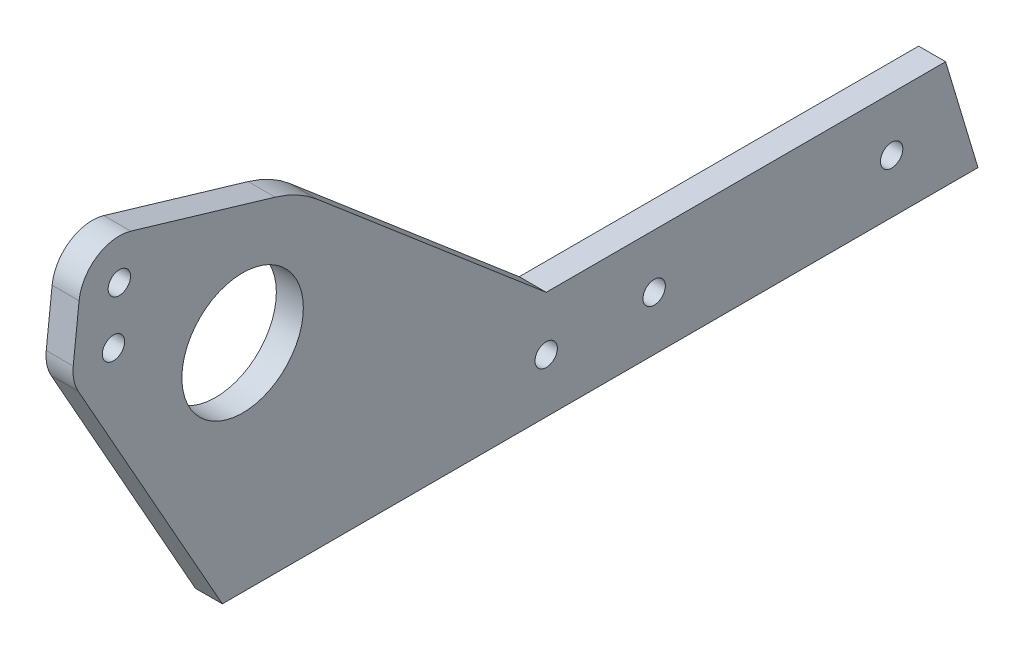
ISO-10303-21;
HEADER;
FILE_DESCRIPTION(('STEP AP214'),'2;1');
FILE_NAME('part.step','',(''),(''),'','','');
FILE_SCHEMA(('AUTOMOTIVE_DESIGN { 1 0 10303 214 1 1 1 1 }'));
ENDSEC;
DATA;
#1=APPLICATION_CONTEXT('core data for automotive mechanical design processes');
#2=APPLICATION_PROTOCOL_DEFINITION('international standard','automotive_design',2000,#1);
#3=PRODUCT_CONTEXT('',#1,'mechanical');
#4=PRODUCT('Part','Part','',(#3));
#5=PRODUCT_RELATED_PRODUCT_CATEGORY('part','',(#4));
#6=PRODUCT_DEFINITION_FORMATION('','',#4);
#7=PRODUCT_DEFINITION_CONTEXT('part definition',#1,'design');
#8=PRODUCT_DEFINITION('design','',#6,#7);
#9=PRODUCT_DEFINITION_SHAPE('','',#8);
#10=(LENGTH_UNIT() NAMED_UNIT(*) SI_UNIT(.MILLI.,.METRE.));
#11=(NAMED_UNIT(*) PLANE_ANGLE_UNIT() SI_UNIT($,.RADIAN.));
#12=(NAMED_UNIT(*) SI_UNIT($,.STERADIAN.) SOLID_ANGLE_UNIT());
#13=UNCERTAINTY_MEASURE_WITH_UNIT(LENGTH_MEASURE(1.E-05),#10,'distance_accuracy_value','');
#14=(GEOMETRIC_REPRESENTATION_CONTEXT(3) GLOBAL_UNCERTAINTY_ASSIGNED_CONTEXT((#13)) GLOBAL_UNIT_ASSIGNED_CONTEXT((#10,
#11,#12)) REPRESENTATION_CONTEXT('',''));
#15=CARTESIAN_POINT('',(0.,0.,0.));
#16=DIRECTION('',(0.,0.,1.));
#17=DIRECTION('',(1.,0.,0.));
#18=AXIS2_PLACEMENT_3D('',#15,#16,#17);
#19=CARTESIAN_POINT('',(6.35,38.1,84.1375));
#20=DIRECTION('',(1.,0.,0.));
#21=DIRECTION('',(0.,0.,-1.));
#22=AXIS2_PLACEMENT_3D('',#19,#20,#21);
#23=PLANE('',#22);
#24=CARTESIAN_POINT('',(6.35,52.2701371540701,114.525457191473));
#25=DIRECTION('',(1.,0.,0.));
#26=DIRECTION('',(0.,0.,-1.));
#27=AXIS2_PLACEMENT_3D('',#24,#25,#26);
#28=CIRCLE('',#27,2.62890000000001);
#29=CARTESIAN_POINT('',(6.35,52.2701371540701,111.896557191473));
#30=VERTEX_POINT('',#29);
#31=EDGE_CURVE('E233',#30,#30,#28,.T.);
#32=ORIENTED_EDGE('',*,*,#31,.F.);
#33=EDGE_LOOP('',(#32));
#34=FACE_BOUND('',#33,.T.);
#35=CARTESIAN_POINT('',(6.35,0.,-12.7));
#36=DIRECTION('',(1.,0.,0.));
#37=DIRECTION('',(0.,0.,-1.));
#38=AXIS2_PLACEMENT_3D('',#35,#36,#37);
#39=CIRCLE('',#38,2.6289);
#40=CARTESIAN_POINT('',(6.35,0.,-15.3289));
#41=VERTEX_POINT('',#40);
#42=EDGE_CURVE('E221',#41,#41,#39,.T.);
#43=ORIENTED_EDGE('',*,*,#42,.F.);
#44=EDGE_LOOP('',(#43));
#45=FACE_BOUND('',#44,.T.);
#46=CARTESIAN_POINT('',(6.35,38.1,84.1375));
#47=DIRECTION('',(1.,0.,0.));
#48=DIRECTION('',(0.,0.,-1.));
#49=AXIS2_PLACEMENT_3D('',#46,#47,#48);
#50=CIRCLE('',#49,14.2875);
#51=CARTESIAN_POINT('',(6.35,38.1,69.85));
#52=VERTEX_POINT('',#51);
#53=EDGE_CURVE('E146',#52,#52,#50,.T.);
#54=ORIENTED_EDGE('',*,*,#53,.F.);
#55=EDGE_LOOP('',(#54));
#56=FACE_BOUND('',#55,.T.);
#57=DIRECTION('',(0.,0.,-1.));
#58=VECTOR('',#57,1.);
#59=CARTESIAN_POINT('',(6.35,-12.7,12.7));
#60=LINE('',#59,#58);
#61=CARTESIAN_POINT('',(6.35,-12.7,88.9));
#62=VERTEX_POINT('',#61);
#63=CARTESIAN_POINT('',(6.35,-12.7,-88.9));
#64=VERTEX_POINT('',#63);
#65=EDGE_CURVE('E50',#62,#64,#60,.T.);
#66=ORIENTED_EDGE('',*,*,#65,.T.);
#67=DIRECTION('',(0.,0.957826285221151,0.287347885566345));
#68=VECTOR('',#67,1.);
#69=CARTESIAN_POINT('',(6.35,-12.7,-88.9));
#70=LINE('',#69,#68);
#71=CARTESIAN_POINT('',(6.35,12.7,-81.28));
#72=VERTEX_POINT('',#71);
#73=EDGE_CURVE('E184',#64,#72,#70,.T.);
#74=ORIENTED_EDGE('',*,*,#73,.T.);
#75=DIRECTION('',(0.,0.,1.));
#76=VECTOR('',#75,1.);
#77=CARTESIAN_POINT('',(6.35,12.7,-25.4));
#78=LINE('',#77,#76);
#79=CARTESIAN_POINT('',(6.35,12.7,12.7));
#80=VERTEX_POINT('',#79);
#81=EDGE_CURVE('E181',#72,#80,#78,.T.);
#82=ORIENTED_EDGE('',*,*,#81,.T.);
#83=DIRECTION('',(0.,0.64844771387176,0.761259195264325));
#84=VECTOR('',#83,1.);
#85=CARTESIAN_POINT('',(6.35,12.7,12.7));
#86=LINE('',#85,#84);
#87=CARTESIAN_POINT('',(6.35,58.644482532196,66.6375173218859));
#88=VERTEX_POINT('',#87);
#89=EDGE_CURVE('E204',#80,#88,#86,.T.);
#90=ORIENTED_EDGE('',*,*,#89,.T.);
#91=CARTESIAN_POINT('',(6.35,38.1,84.1375));
#92=DIRECTION('',(1.,0.,0.));
#93=DIRECTION('',(0.,0.,-1.));
#94=AXIS2_PLACEMENT_3D('',#91,#92,#93);
#95=CIRCLE('',#94,26.9875);
#96=CARTESIAN_POINT('',(6.35,63.9781424518696,76.4793736305319));
#97=VERTEX_POINT('',#96);
#98=EDGE_CURVE('E201',#88,#97,#95,.T.);
#99=ORIENTED_EDGE('',*,*,#98,.T.);
#100=DIRECTION('',(0.,0.28376568298168,0.95889365268623));
#101=VECTOR('',#100,1.);
#102=CARTESIAN_POINT('',(6.35,74.0281146913299,110.439979750453));
#103=LINE('',#102,#101);
#104=CARTESIAN_POINT('',(6.35,74.0281146913299,110.439979750453));
#105=VERTEX_POINT('',#104);
#106=EDGE_CURVE('E203',#97,#105,#103,.T.);
#107=ORIENTED_EDGE('',*,*,#106,.T.);
#108=CARTESIAN_POINT('',(6.35,64.8946526494935,113.142847880853));
#109=DIRECTION('',(1.,0.,0.));
#110=DIRECTION('',(0.,0.,1.));
#111=AXIS2_PLACEMENT_3D('',#108,#109,#110);
#112=CIRCLE('',#111,9.525);
#113=CARTESIAN_POINT('',(6.35,65.9316096324584,122.611234502421));
#114=VERTEX_POINT('',#113);
#115=EDGE_CURVE('E122',#105,#114,#112,.T.);
#116=ORIENTED_EDGE('',*,*,#115,.T.);
#117=DIRECTION('',(0.,-0.99405633822232,0.108866874851962));
#118=VECTOR('',#117,1.);
#119=CARTESIAN_POINT('',(6.35,53.307094137035,123.993843813041));
#120=LINE('',#119,#118);
#121=CARTESIAN_POINT('',(6.35,53.307094137035,123.993843813041));
#122=VERTEX_POINT('',#121);
#123=EDGE_CURVE('E116',#114,#122,#120,.T.);
#124=ORIENTED_EDGE('',*,*,#123,.T.);
#125=CARTESIAN_POINT('',(6.35,52.2701371540701,114.525457191473));
#126=DIRECTION('',(1.,0.,0.));
#127=DIRECTION('',(0.,0.,1.));
#128=AXIS2_PLACEMENT_3D('',#125,#126,#127);
#129=CIRCLE('',#128,9.525);
#130=CARTESIAN_POINT('',(6.35,47.5995371719805,122.826729431757));
#131=VERTEX_POINT('',#130);
#132=EDGE_CURVE('E120',#122,#131,#129,.T.);
#133=ORIENTED_EDGE('',*,*,#132,.T.);
#134=DIRECTION('',(0.,-0.871524644649208,-0.490351704156385));
#135=VECTOR('',#134,1.);
#136=CARTESIAN_POINT('',(6.35,-12.7,88.9));
#137=LINE('',#136,#135);
#138=EDGE_CURVE('E136',#131,#62,#137,.T.);
#139=ORIENTED_EDGE('',*,*,#138,.T.);
#140=EDGE_LOOP('',(#66,#74,#82,#90,#99,#107,#116,#124,#133,#139));
#141=FACE_BOUND('',#140,.T.);
#142=CARTESIAN_POINT('',(6.35,0.,12.7));
#143=DIRECTION('',(1.,0.,0.));
#144=DIRECTION('',(0.,0.,-1.));
#145=AXIS2_PLACEMENT_3D('',#142,#143,#144);
#146=CIRCLE('',#145,2.6289);
#147=CARTESIAN_POINT('',(6.35,0.,10.0711));
#148=VERTEX_POINT('',#147);
#149=EDGE_CURVE('E215',#148,#148,#146,.T.);
#150=ORIENTED_EDGE('',*,*,#149,.F.);
#151=EDGE_LOOP('',(#150));
#152=FACE_BOUND('',#151,.T.);
#153=CARTESIAN_POINT('',(6.35,0.,-68.58));
#154=DIRECTION('',(1.,0.,0.));
#155=DIRECTION('',(0.,0.,-1.));
#156=AXIS2_PLACEMENT_3D('',#153,#154,#155);
#157=CIRCLE('',#156,2.62890000000001);
#158=CARTESIAN_POINT('',(6.35,0.,-71.2089));
#159=VERTEX_POINT('',#158);
#160=EDGE_CURVE('E227',#159,#159,#157,.T.);
#161=ORIENTED_EDGE('',*,*,#160,.F.);
#162=EDGE_LOOP('',(#161));
#163=FACE_BOUND('',#162,.T.);
#164=CARTESIAN_POINT('',(6.35,64.8946526494935,113.142847880853));
#165=DIRECTION('',(1.,0.,0.));
#166=DIRECTION('',(0.,0.,-1.));
#167=AXIS2_PLACEMENT_3D('',#164,#165,#166);
#168=CIRCLE('',#167,2.62889999999995);
#169=CARTESIAN_POINT('',(6.35,64.8946526494935,110.513947880854));
#170=VERTEX_POINT('',#169);
#171=EDGE_CURVE('E239',#170,#170,#168,.T.);
#172=ORIENTED_EDGE('',*,*,#171,.F.);
#173=EDGE_LOOP('',(#172));
#174=FACE_BOUND('',#173,.T.);
#175=ADVANCED_FACE('F33',(#34,#45,#56,#141,#152,#163,#174),#23,.T.);
#176=CARTESIAN_POINT('',(0.,38.1,84.1375));
#177=DIRECTION('',(1.,0.,0.));
#178=DIRECTION('',(0.,0.,-1.));
#179=AXIS2_PLACEMENT_3D('',#176,#177,#178);
#180=PLANE('',#179);
#181=DIRECTION('',(0.,0.957826285221151,0.287347885566345));
#182=VECTOR('',#181,1.);
#183=CARTESIAN_POINT('',(0.,-12.7,-88.9));
#184=LINE('',#183,#182);
#185=CARTESIAN_POINT('',(0.,-12.7,-88.9));
#186=VERTEX_POINT('',#185);
#187=CARTESIAN_POINT('',(0.,12.7,-81.28));
#188=VERTEX_POINT('',#187);
#189=EDGE_CURVE('E142',#186,#188,#184,.T.);
#190=ORIENTED_EDGE('',*,*,#189,.F.);
#191=DIRECTION('',(0.,0.,-1.));
#192=VECTOR('',#191,1.);
#193=CARTESIAN_POINT('',(0.,-12.7,12.7));
#194=LINE('',#193,#192);
#195=CARTESIAN_POINT('',(0.,-12.7,88.9));
#196=VERTEX_POINT('',#195);
#197=EDGE_CURVE('E159',#196,#186,#194,.T.);
#198=ORIENTED_EDGE('',*,*,#197,.F.);
#199=DIRECTION('',(0.,-0.871524644649208,-0.490351704156385));
#200=VECTOR('',#199,1.);
#201=CARTESIAN_POINT('',(0.,-12.7,88.9));
#202=LINE('',#201,#200);
#203=CARTESIAN_POINT('',(0.,47.5995371719805,122.826729431757));
#204=VERTEX_POINT('',#203);
#205=EDGE_CURVE('E93',#204,#196,#202,.T.);
#206=ORIENTED_EDGE('',*,*,#205,.F.);
#207=CARTESIAN_POINT('',(0.,52.2701371540701,114.525457191473));
#208=DIRECTION('',(1.,0.,0.));
#209=DIRECTION('',(0.,0.,1.));
#210=AXIS2_PLACEMENT_3D('',#207,#208,#209);
#211=CIRCLE('',#210,9.525);
#212=CARTESIAN_POINT('',(0.,53.307094137035,123.993843813041));
#213=VERTEX_POINT('',#212);
#214=EDGE_CURVE('E86',#213,#204,#211,.T.);
#215=ORIENTED_EDGE('',*,*,#214,.F.);
#216=DIRECTION('',(0.,-0.99405633822232,0.108866874851962));
#217=VECTOR('',#216,1.);
#218=CARTESIAN_POINT('',(0.,53.307094137035,123.993843813041));
#219=LINE('',#218,#217);
#220=CARTESIAN_POINT('',(0.,65.9316096324584,122.611234502421));
#221=VERTEX_POINT('',#220);
#222=EDGE_CURVE('E130',#221,#213,#219,.T.);
#223=ORIENTED_EDGE('',*,*,#222,.F.);
#224=CARTESIAN_POINT('',(0.,64.8946526494935,113.142847880853));
#225=DIRECTION('',(1.,0.,0.));
#226=DIRECTION('',(0.,0.,1.));
#227=AXIS2_PLACEMENT_3D('',#224,#225,#226);
#228=CIRCLE('',#227,9.525);
#229=CARTESIAN_POINT('',(0.,74.0281146913299,110.439979750453));
#230=VERTEX_POINT('',#229);
#231=EDGE_CURVE('E154',#230,#221,#228,.T.);
#232=ORIENTED_EDGE('',*,*,#231,.F.);
#233=DIRECTION('',(0.,0.28376568298168,0.95889365268623));
#234=VECTOR('',#233,1.);
#235=CARTESIAN_POINT('',(0.,74.0281146913299,110.439979750453));
#236=LINE('',#235,#234);
#237=CARTESIAN_POINT('',(0.,63.9781424518696,76.4793736305319));
#238=VERTEX_POINT('',#237);
#239=EDGE_CURVE('E152',#238,#230,#236,.T.);
#240=ORIENTED_EDGE('',*,*,#239,.F.);
#241=CARTESIAN_POINT('',(0.,38.1,84.1375));
#242=DIRECTION('',(1.,0.,0.));
#243=DIRECTION('',(0.,0.,-1.));
#244=AXIS2_PLACEMENT_3D('',#241,#242,#243);
#245=CIRCLE('',#244,26.9875);
#246=CARTESIAN_POINT('',(0.,58.644482532196,66.6375173218859));
#247=VERTEX_POINT('',#246);
#248=EDGE_CURVE('E150',#247,#238,#245,.T.);
#249=ORIENTED_EDGE('',*,*,#248,.F.);
#250=DIRECTION('',(0.,0.64844771387176,0.761259195264325));
#251=VECTOR('',#250,1.);
#252=CARTESIAN_POINT('',(0.,12.7,12.7));
#253=LINE('',#252,#251);
#254=CARTESIAN_POINT('',(0.,12.7,12.7));
#255=VERTEX_POINT('',#254);
#256=EDGE_CURVE('E148',#255,#247,#253,.T.);
#257=ORIENTED_EDGE('',*,*,#256,.F.);
#258=DIRECTION('',(0.,0.,1.));
#259=VECTOR('',#258,1.);
#260=CARTESIAN_POINT('',(0.,12.7,12.7));
#261=LINE('',#260,#259);
#262=EDGE_CURVE('E145',#188,#255,#261,.T.);
#263=ORIENTED_EDGE('',*,*,#262,.F.);
#264=EDGE_LOOP('',(#190,#198,#206,#215,#223,#232,#240,#249,#257,#263));
#265=FACE_BOUND('',#264,.T.);
#266=CARTESIAN_POINT('',(0.,38.1,84.1375));
#267=DIRECTION('',(1.,0.,0.));
#268=DIRECTION('',(0.,0.,-1.));
#269=AXIS2_PLACEMENT_3D('',#266,#267,#268);
#270=CIRCLE('',#269,14.2875);
#271=CARTESIAN_POINT('',(0.,38.1,69.85));
#272=VERTEX_POINT('',#271);
#273=EDGE_CURVE('E212',#272,#272,#270,.T.);
#274=ORIENTED_EDGE('',*,*,#273,.T.);
#275=EDGE_LOOP('',(#274));
#276=FACE_BOUND('',#275,.T.);
#277=CARTESIAN_POINT('',(0.,0.,12.7));
#278=DIRECTION('',(1.,0.,0.));
#279=DIRECTION('',(0.,0.,-1.));
#280=AXIS2_PLACEMENT_3D('',#277,#278,#279);
#281=CIRCLE('',#280,2.6289);
#282=CARTESIAN_POINT('',(0.,0.,10.0711));
#283=VERTEX_POINT('',#282);
#284=EDGE_CURVE('E218',#283,#283,#281,.T.);
#285=ORIENTED_EDGE('',*,*,#284,.T.);
#286=EDGE_LOOP('',(#285));
#287=FACE_BOUND('',#286,.T.);
#288=CARTESIAN_POINT('',(0.,0.,-12.7));
#289=DIRECTION('',(1.,0.,0.));
#290=DIRECTION('',(0.,0.,-1.));
#291=AXIS2_PLACEMENT_3D('',#288,#289,#290);
#292=CIRCLE('',#291,2.6289);
#293=CARTESIAN_POINT('',(0.,0.,-15.3289));
#294=VERTEX_POINT('',#293);
#295=EDGE_CURVE('E224',#294,#294,#292,.T.);
#296=ORIENTED_EDGE('',*,*,#295,.T.);
#297=EDGE_LOOP('',(#296));
#298=FACE_BOUND('',#297,.T.);
#299=CARTESIAN_POINT('',(0.,0.,-68.58));
#300=DIRECTION('',(1.,0.,0.));
#301=DIRECTION('',(0.,0.,-1.));
#302=AXIS2_PLACEMENT_3D('',#299,#300,#301);
#303=CIRCLE('',#302,2.62890000000001);
#304=CARTESIAN_POINT('',(0.,0.,-71.2089));
#305=VERTEX_POINT('',#304);
#306=EDGE_CURVE('E230',#305,#305,#303,.T.);
#307=ORIENTED_EDGE('',*,*,#306,.T.);
#308=EDGE_LOOP('',(#307));
#309=FACE_BOUND('',#308,.T.);
#310=CARTESIAN_POINT('',(0.,52.2701371540701,114.525457191473));
#311=DIRECTION('',(1.,0.,0.));
#312=DIRECTION('',(0.,0.,-1.));
#313=AXIS2_PLACEMENT_3D('',#310,#311,#312);
#314=CIRCLE('',#313,2.62890000000001);
#315=CARTESIAN_POINT('',(0.,52.2701371540701,111.896557191473));
#316=VERTEX_POINT('',#315);
#317=EDGE_CURVE('E236',#316,#316,#314,.T.);
#318=ORIENTED_EDGE('',*,*,#317,.T.);
#319=EDGE_LOOP('',(#318));
#320=FACE_BOUND('',#319,.T.);
#321=CARTESIAN_POINT('',(0.,64.8946526494935,113.142847880853));
#322=DIRECTION('',(1.,0.,0.));
#323=DIRECTION('',(0.,0.,-1.));
#324=AXIS2_PLACEMENT_3D('',#321,#322,#323);
#325=CIRCLE('',#324,2.62889999999995);
#326=CARTESIAN_POINT('',(0.,64.8946526494935,110.513947880854));
#327=VERTEX_POINT('',#326);
#328=EDGE_CURVE('E242',#327,#327,#325,.T.);
#329=ORIENTED_EDGE('',*,*,#328,.T.);
#330=EDGE_LOOP('',(#329));
#331=FACE_BOUND('',#330,.T.);
#332=ADVANCED_FACE('F188',(#265,#276,#287,#298,#309,#320,#331),#180,.F.);
#333=CARTESIAN_POINT('',(6.35,-12.7,-88.9));
#334=DIRECTION('',(0.,-0.287347885566345,0.957826285221151));
#335=DIRECTION('',(0.,-0.957826285221152,-0.287347885566346));
#336=AXIS2_PLACEMENT_3D('',#333,#334,#335);
#337=PLANE('',#336);
#338=ORIENTED_EDGE('',*,*,#189,.T.);
#339=DIRECTION('',(-1.,0.,0.));
#340=VECTOR('',#339,1.);
#341=CARTESIAN_POINT('',(6.35,12.7,-81.28));
#342=LINE('',#341,#340);
#343=EDGE_CURVE('E42',#72,#188,#342,.T.);
#344=ORIENTED_EDGE('',*,*,#343,.F.);
#345=ORIENTED_EDGE('',*,*,#73,.F.);
#346=DIRECTION('',(-1.,0.,0.));
#347=VECTOR('',#346,1.);
#348=CARTESIAN_POINT('',(6.35,-12.7,-88.9));
#349=LINE('',#348,#347);
#350=EDGE_CURVE('E11',#64,#186,#349,.T.);
#351=ORIENTED_EDGE('',*,*,#350,.T.);
#352=EDGE_LOOP('',(#338,#344,#345,#351));
#353=FACE_BOUND('',#352,.T.);
#354=ADVANCED_FACE('F35',(#353),#337,.F.);
#355=CARTESIAN_POINT('',(6.35,12.7,12.7));
#356=DIRECTION('',(0.,-1.,0.));
#357=DIRECTION('',(0.,0.,-1.));
#358=AXIS2_PLACEMENT_3D('',#355,#356,#357);
#359=PLANE('',#358);
#360=ORIENTED_EDGE('',*,*,#262,.T.);
#361=DIRECTION('',(-1.,0.,0.));
#362=VECTOR('',#361,1.);
#363=CARTESIAN_POINT('',(6.35,12.7,12.7));
#364=LINE('',#363,#362);
#365=EDGE_CURVE('E173',#80,#255,#364,.T.);
#366=ORIENTED_EDGE('',*,*,#365,.F.);
#367=ORIENTED_EDGE('',*,*,#81,.F.);
#368=ORIENTED_EDGE('',*,*,#343,.T.);
#369=EDGE_LOOP('',(#360,#366,#367,#368));
#370=FACE_BOUND('',#369,.T.);
#371=ADVANCED_FACE('F179',(#370),#359,.F.);
#372=CARTESIAN_POINT('',(6.35,12.7,12.7));
#373=DIRECTION('',(0.,-0.761259195264325,0.64844771387176));
#374=DIRECTION('',(0.,-0.64844771387176,-0.761259195264325));
#375=AXIS2_PLACEMENT_3D('',#372,#373,#374);
#376=PLANE('',#375);
#377=ORIENTED_EDGE('',*,*,#256,.T.);
#378=DIRECTION('',(-1.,0.,0.));
#379=VECTOR('',#378,1.);
#380=CARTESIAN_POINT('',(6.35,58.644482532196,66.6375173218859));
#381=LINE('',#380,#379);
#382=EDGE_CURVE('E170',#88,#247,#381,.T.);
#383=ORIENTED_EDGE('',*,*,#382,.F.);
#384=ORIENTED_EDGE('',*,*,#89,.F.);
#385=ORIENTED_EDGE('',*,*,#365,.T.);
#386=EDGE_LOOP('',(#377,#383,#384,#385));
#387=FACE_BOUND('',#386,.T.);
#388=ADVANCED_FACE('F195',(#387),#376,.F.);
#389=CARTESIAN_POINT('',(6.35,38.1,84.1375));
#390=DIRECTION('',(-1.,0.,0.));
#391=DIRECTION('',(0.,0.,1.));
#392=AXIS2_PLACEMENT_3D('',#389,#390,#391);
#393=CYLINDRICAL_SURFACE('',#392,26.9875);
#394=ORIENTED_EDGE('',*,*,#248,.T.);
#395=DIRECTION('',(-1.,0.,0.));
#396=VECTOR('',#395,1.);
#397=CARTESIAN_POINT('',(6.35,63.9781424518696,76.4793736305319));
#398=LINE('',#397,#396);
#399=EDGE_CURVE('E167',#97,#238,#398,.T.);
#400=ORIENTED_EDGE('',*,*,#399,.F.);
#401=ORIENTED_EDGE('',*,*,#98,.F.);
#402=ORIENTED_EDGE('',*,*,#382,.T.);
#403=EDGE_LOOP('',(#394,#400,#401,#402));
#404=FACE_BOUND('',#403,.T.);
#405=ADVANCED_FACE('F199',(#404),#393,.T.);
#406=CARTESIAN_POINT('',(6.35,74.0281146913299,110.439979750453));
#407=DIRECTION('',(0.,-0.95889365268623,0.28376568298168));
#408=DIRECTION('',(0.,-0.28376568298168,-0.958893652686231));
#409=AXIS2_PLACEMENT_3D('',#406,#407,#408);
#410=PLANE('',#409);
#411=ORIENTED_EDGE('',*,*,#239,.T.);
#412=DIRECTION('',(-1.,0.,0.));
#413=VECTOR('',#412,1.);
#414=CARTESIAN_POINT('',(6.35,74.0281146913299,110.439979750453));
#415=LINE('',#414,#413);
#416=EDGE_CURVE('E164',#105,#230,#415,.T.);
#417=ORIENTED_EDGE('',*,*,#416,.F.);
#418=ORIENTED_EDGE('',*,*,#106,.F.);
#419=ORIENTED_EDGE('',*,*,#399,.T.);
#420=EDGE_LOOP('',(#411,#417,#418,#419));
#421=FACE_BOUND('',#420,.T.);
#422=ADVANCED_FACE('F277',(#421),#410,.F.);
#423=CARTESIAN_POINT('',(6.35,64.8946526494935,113.142847880853));
#424=DIRECTION('',(-1.,0.,0.));
#425=DIRECTION('',(0.,0.,1.));
#426=AXIS2_PLACEMENT_3D('',#423,#424,#425);
#427=CYLINDRICAL_SURFACE('',#426,9.525);
#428=ORIENTED_EDGE('',*,*,#231,.T.);
#429=DIRECTION('',(-1.,0.,0.));
#430=VECTOR('',#429,1.);
#431=CARTESIAN_POINT('',(6.35,65.9316096324584,122.611234502421));
#432=LINE('',#431,#430);
#433=EDGE_CURVE('E131',#114,#221,#432,.T.);
#434=ORIENTED_EDGE('',*,*,#433,.F.);
#435=ORIENTED_EDGE('',*,*,#115,.F.);
#436=ORIENTED_EDGE('',*,*,#416,.T.);
#437=EDGE_LOOP('',(#428,#434,#435,#436));
#438=FACE_BOUND('',#437,.T.);
#439=ADVANCED_FACE('F274',(#438),#427,.T.);
#440=CARTESIAN_POINT('',(6.35,53.307094137035,123.993843813041));
#441=DIRECTION('',(0.,-0.108866874851962,-0.99405633822232));
#442=DIRECTION('',(0.,0.99405633822232,-0.108866874851962));
#443=AXIS2_PLACEMENT_3D('',#440,#441,#442);
#444=PLANE('',#443);
#445=ORIENTED_EDGE('',*,*,#222,.T.);
#446=DIRECTION('',(-1.,0.,0.));
#447=VECTOR('',#446,1.);
#448=CARTESIAN_POINT('',(6.35,53.307094137035,123.993843813041));
#449=LINE('',#448,#447);
#450=EDGE_CURVE('E127',#122,#213,#449,.T.);
#451=ORIENTED_EDGE('',*,*,#450,.F.);
#452=ORIENTED_EDGE('',*,*,#123,.F.);
#453=ORIENTED_EDGE('',*,*,#433,.T.);
#454=EDGE_LOOP('',(#445,#451,#452,#453));
#455=FACE_BOUND('',#454,.T.);
#456=ADVANCED_FACE('F128',(#455),#444,.F.);
#457=CARTESIAN_POINT('',(6.35,52.2701371540701,114.525457191473));
#458=DIRECTION('',(-1.,0.,0.));
#459=DIRECTION('',(0.,0.,1.));
#460=AXIS2_PLACEMENT_3D('',#457,#458,#459);
#461=CYLINDRICAL_SURFACE('',#460,9.525);
#462=ORIENTED_EDGE('',*,*,#214,.T.);
#463=DIRECTION('',(-1.,0.,0.));
#464=VECTOR('',#463,1.);
#465=CARTESIAN_POINT('',(6.35,47.5995371719805,122.826729431757));
#466=LINE('',#465,#464);
#467=EDGE_CURVE('E132',#131,#204,#466,.T.);
#468=ORIENTED_EDGE('',*,*,#467,.F.);
#469=ORIENTED_EDGE('',*,*,#132,.F.);
#470=ORIENTED_EDGE('',*,*,#450,.T.);
#471=EDGE_LOOP('',(#462,#468,#469,#470));
#472=FACE_BOUND('',#471,.T.);
#473=ADVANCED_FACE('F134',(#472),#461,.T.);
#474=CARTESIAN_POINT('',(6.35,-12.7,88.9));
#475=DIRECTION('',(0.,0.490351704156386,-0.871524644649208));
#476=DIRECTION('',(0.,0.871524644649208,0.490351704156386));
#477=AXIS2_PLACEMENT_3D('',#474,#475,#476);
#478=PLANE('',#477);
#479=ORIENTED_EDGE('',*,*,#205,.T.);
#480=DIRECTION('',(-1.,0.,0.));
#481=VECTOR('',#480,1.);
#482=CARTESIAN_POINT('',(6.35,-12.7,88.9));
#483=LINE('',#482,#481);
#484=EDGE_CURVE('E138',#62,#196,#483,.T.);
#485=ORIENTED_EDGE('',*,*,#484,.F.);
#486=ORIENTED_EDGE('',*,*,#138,.F.);
#487=ORIENTED_EDGE('',*,*,#467,.T.);
#488=EDGE_LOOP('',(#479,#485,#486,#487));
#489=FACE_BOUND('',#488,.T.);
#490=ADVANCED_FACE('F267',(#489),#478,.F.);
#491=CARTESIAN_POINT('',(6.35,-12.7,12.7));
#492=DIRECTION('',(0.,1.,0.));
#493=DIRECTION('',(0.,0.,1.));
#494=AXIS2_PLACEMENT_3D('',#491,#492,#493);
#495=PLANE('',#494);
#496=ORIENTED_EDGE('',*,*,#197,.T.);
#497=ORIENTED_EDGE('',*,*,#350,.F.);
#498=ORIENTED_EDGE('',*,*,#65,.F.);
#499=ORIENTED_EDGE('',*,*,#484,.T.);
#500=EDGE_LOOP('',(#496,#497,#498,#499));
#501=FACE_BOUND('',#500,.T.);
#502=ADVANCED_FACE('F264',(#501),#495,.F.);
#503=CARTESIAN_POINT('',(6.35,38.1,84.1375));
#504=DIRECTION('',(-1.,0.,0.));
#505=DIRECTION('',(0.,0.,1.));
#506=AXIS2_PLACEMENT_3D('',#503,#504,#505);
#507=CYLINDRICAL_SURFACE('',#506,14.2875);
#508=ORIENTED_EDGE('',*,*,#53,.T.);
#509=EDGE_LOOP('',(#508));
#510=FACE_BOUND('',#509,.T.);
#511=ORIENTED_EDGE('',*,*,#273,.F.);
#512=EDGE_LOOP('',(#511));
#513=FACE_BOUND('',#512,.T.);
#514=ADVANCED_FACE('F261',(#510,#513),#507,.F.);
#515=CARTESIAN_POINT('',(6.35,0.,12.7));
#516=DIRECTION('',(-1.,0.,0.));
#517=DIRECTION('',(0.,0.,1.));
#518=AXIS2_PLACEMENT_3D('',#515,#516,#517);
#519=CYLINDRICAL_SURFACE('',#518,2.6289);
#520=ORIENTED_EDGE('',*,*,#149,.T.);
#521=EDGE_LOOP('',(#520));
#522=FACE_BOUND('',#521,.T.);
#523=ORIENTED_EDGE('',*,*,#284,.F.);
#524=EDGE_LOOP('',(#523));
#525=FACE_BOUND('',#524,.T.);
#526=ADVANCED_FACE('F364',(#522,#525),#519,.F.);
#527=CARTESIAN_POINT('',(6.35,0.,-12.7));
#528=DIRECTION('',(-1.,0.,0.));
#529=DIRECTION('',(0.,0.,1.));
#530=AXIS2_PLACEMENT_3D('',#527,#528,#529);
#531=CYLINDRICAL_SURFACE('',#530,2.6289);
#532=ORIENTED_EDGE('',*,*,#42,.T.);
#533=EDGE_LOOP('',(#532));
#534=FACE_BOUND('',#533,.T.);
#535=ORIENTED_EDGE('',*,*,#295,.F.);
#536=EDGE_LOOP('',(#535));
#537=FACE_BOUND('',#536,.T.);
#538=ADVANCED_FACE('F372',(#534,#537),#531,.F.);
#539=CARTESIAN_POINT('',(6.35,0.,-68.58));
#540=DIRECTION('',(-1.,0.,0.));
#541=DIRECTION('',(0.,0.,1.));
#542=AXIS2_PLACEMENT_3D('',#539,#540,#541);
#543=CYLINDRICAL_SURFACE('',#542,2.62890000000001);
#544=ORIENTED_EDGE('',*,*,#160,.T.);
#545=EDGE_LOOP('',(#544));
#546=FACE_BOUND('',#545,.T.);
#547=ORIENTED_EDGE('',*,*,#306,.F.);
#548=EDGE_LOOP('',(#547));
#549=FACE_BOUND('',#548,.T.);
#550=ADVANCED_FACE('F380',(#546,#549),#543,.F.);
#551=CARTESIAN_POINT('',(6.35,52.2701371540701,114.525457191473));
#552=DIRECTION('',(-1.,0.,0.));
#553=DIRECTION('',(0.,0.,1.));
#554=AXIS2_PLACEMENT_3D('',#551,#552,#553);
#555=CYLINDRICAL_SURFACE('',#554,2.62890000000001);
#556=ORIENTED_EDGE('',*,*,#31,.T.);
#557=EDGE_LOOP('',(#556));
#558=FACE_BOUND('',#557,.T.);
#559=ORIENTED_EDGE('',*,*,#317,.F.);
#560=EDGE_LOOP('',(#559));
#561=FACE_BOUND('',#560,.T.);
#562=ADVANCED_FACE('F389',(#558,#561),#555,.F.);
#563=CARTESIAN_POINT('',(6.35,64.8946526494935,113.142847880853));
#564=DIRECTION('',(-1.,0.,0.));
#565=DIRECTION('',(0.,0.,1.));
#566=AXIS2_PLACEMENT_3D('',#563,#564,#565);
#567=CYLINDRICAL_SURFACE('',#566,2.62889999999995);
#568=ORIENTED_EDGE('',*,*,#171,.T.);
#569=EDGE_LOOP('',(#568));
#570=FACE_BOUND('',#569,.T.);
#571=ORIENTED_EDGE('',*,*,#328,.F.);
#572=EDGE_LOOP('',(#571));
#573=FACE_BOUND('',#572,.T.);
#574=ADVANCED_FACE('F248',(#570,#573),#567,.F.);
#575=CLOSED_SHELL('',(#175,#332,#354,#371,#388,#405,#422,#439,#456,#473,#490,#502,#514,#526,
#538,#550,#562,#574));
#576=MANIFOLD_SOLID_BREP('B2',#575);
#577=ADVANCED_BREP_SHAPE_REPRESENTATION('',(#18,#576),#14);
#578=SHAPE_DEFINITION_REPRESENTATION(#9,#577);
ENDSEC;
END-ISO-10303-21;
